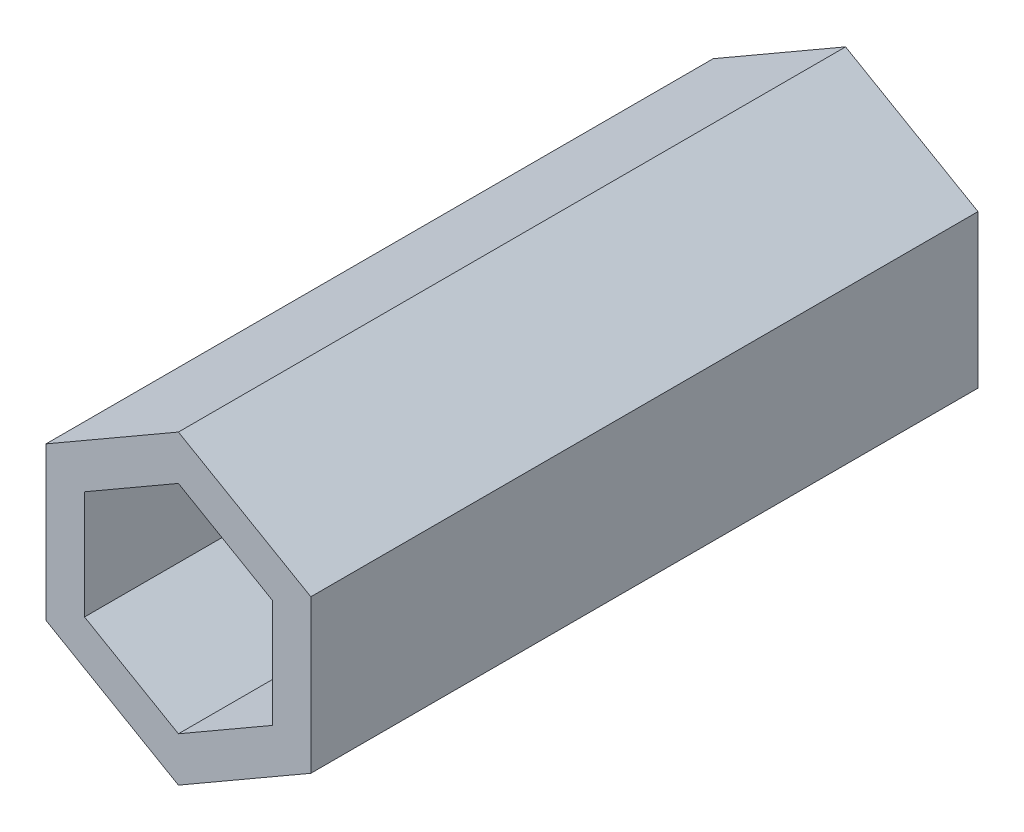
ISO-10303-21;
HEADER;
FILE_DESCRIPTION(('STEP AP214'),'2;1');
FILE_NAME('part.step','',(''),(''),'','','');
FILE_SCHEMA(('AUTOMOTIVE_DESIGN { 1 0 10303 214 1 1 1 1 }'));
ENDSEC;
DATA;
#1=APPLICATION_CONTEXT('core data for automotive mechanical design processes');
#2=APPLICATION_PROTOCOL_DEFINITION('international standard','automotive_design',2000,#1);
#3=PRODUCT_CONTEXT('',#1,'mechanical');
#4=PRODUCT('Part','Part','',(#3));
#5=PRODUCT_RELATED_PRODUCT_CATEGORY('part','',(#4));
#6=PRODUCT_DEFINITION_FORMATION('','',#4);
#7=PRODUCT_DEFINITION_CONTEXT('part definition',#1,'design');
#8=PRODUCT_DEFINITION('design','',#6,#7);
#9=PRODUCT_DEFINITION_SHAPE('','',#8);
#10=(LENGTH_UNIT() NAMED_UNIT(*) SI_UNIT(.MILLI.,.METRE.));
#11=(NAMED_UNIT(*) PLANE_ANGLE_UNIT() SI_UNIT($,.RADIAN.));
#12=(NAMED_UNIT(*) SI_UNIT($,.STERADIAN.) SOLID_ANGLE_UNIT());
#13=UNCERTAINTY_MEASURE_WITH_UNIT(LENGTH_MEASURE(1.E-05),#10,'distance_accuracy_value','');
#14=(GEOMETRIC_REPRESENTATION_CONTEXT(3) GLOBAL_UNCERTAINTY_ASSIGNED_CONTEXT((#13)) GLOBAL_UNIT_ASSIGNED_CONTEXT((#10,
#11,#12)) REPRESENTATION_CONTEXT('',''));
#15=CARTESIAN_POINT('',(0.,0.,0.));
#16=DIRECTION('',(0.,0.,1.));
#17=DIRECTION('',(1.,0.,0.));
#18=AXIS2_PLACEMENT_3D('',#15,#16,#17);
#19=CARTESIAN_POINT('',(-4.76313972081441,-8.25,24.));
#20=DIRECTION('',(0.5,0.866025403784439,0.));
#21=DIRECTION('',(-0.866025403784439,0.5,0.));
#22=AXIS2_PLACEMENT_3D('',#19,#20,#21);
#23=PLANE('',#22);
#24=DIRECTION('',(0.866025403784439,-0.5,0.));
#25=VECTOR('',#24,1.);
#26=CARTESIAN_POINT('',(-4.76313972081441,-8.25,-24.));
#27=LINE('',#26,#25);
#28=CARTESIAN_POINT('',(-9.52627944162882,-5.5,-24.));
#29=VERTEX_POINT('',#28);
#30=CARTESIAN_POINT('',(0.,-11.,-24.));
#31=VERTEX_POINT('',#30);
#32=EDGE_CURVE('E228',#29,#31,#27,.T.);
#33=ORIENTED_EDGE('',*,*,#32,.T.);
#34=DIRECTION('',(0.,0.,-1.));
#35=VECTOR('',#34,1.);
#36=CARTESIAN_POINT('',(0.,-11.,24.));
#37=LINE('',#36,#35);
#38=CARTESIAN_POINT('',(0.,-11.,24.));
#39=VERTEX_POINT('',#38);
#40=EDGE_CURVE('E67',#39,#31,#37,.T.);
#41=ORIENTED_EDGE('',*,*,#40,.F.);
#42=DIRECTION('',(0.866025403784439,-0.5,0.));
#43=VECTOR('',#42,1.);
#44=CARTESIAN_POINT('',(-4.76313972081441,-8.25,24.));
#45=LINE('',#44,#43);
#46=CARTESIAN_POINT('',(-9.52627944162882,-5.5,24.));
#47=VERTEX_POINT('',#46);
#48=EDGE_CURVE('E212',#47,#39,#45,.T.);
#49=ORIENTED_EDGE('',*,*,#48,.F.);
#50=DIRECTION('',(0.,0.,-1.));
#51=VECTOR('',#50,1.);
#52=CARTESIAN_POINT('',(-9.52627944162882,-5.5,24.));
#53=LINE('',#52,#51);
#54=EDGE_CURVE('E12',#47,#29,#53,.T.);
#55=ORIENTED_EDGE('',*,*,#54,.T.);
#56=EDGE_LOOP('',(#33,#41,#49,#55));
#57=FACE_BOUND('',#56,.T.);
#58=ADVANCED_FACE('F59',(#57),#23,.F.);
#59=CARTESIAN_POINT('',(4.76313972081441,-8.25,24.));
#60=DIRECTION('',(-0.5,0.866025403784439,0.));
#61=DIRECTION('',(-0.866025403784439,-0.5,0.));
#62=AXIS2_PLACEMENT_3D('',#59,#60,#61);
#63=PLANE('',#62);
#64=DIRECTION('',(0.866025403784439,0.5,0.));
#65=VECTOR('',#64,1.);
#66=CARTESIAN_POINT('',(4.76313972081441,-8.25,-24.));
#67=LINE('',#66,#65);
#68=CARTESIAN_POINT('',(9.52627944162883,-5.5,-24.));
#69=VERTEX_POINT('',#68);
#70=EDGE_CURVE('E231',#31,#69,#67,.T.);
#71=ORIENTED_EDGE('',*,*,#70,.T.);
#72=DIRECTION('',(0.,0.,-1.));
#73=VECTOR('',#72,1.);
#74=CARTESIAN_POINT('',(9.52627944162883,-5.5,24.));
#75=LINE('',#74,#73);
#76=CARTESIAN_POINT('',(9.52627944162883,-5.5,24.));
#77=VERTEX_POINT('',#76);
#78=EDGE_CURVE('E247',#77,#69,#75,.T.);
#79=ORIENTED_EDGE('',*,*,#78,.F.);
#80=DIRECTION('',(0.866025403784439,0.5,0.));
#81=VECTOR('',#80,1.);
#82=CARTESIAN_POINT('',(4.76313972081441,-8.25,24.));
#83=LINE('',#82,#81);
#84=EDGE_CURVE('E215',#39,#77,#83,.T.);
#85=ORIENTED_EDGE('',*,*,#84,.F.);
#86=ORIENTED_EDGE('',*,*,#40,.T.);
#87=EDGE_LOOP('',(#71,#79,#85,#86));
#88=FACE_BOUND('',#87,.T.);
#89=ADVANCED_FACE('F254',(#88),#63,.F.);
#90=CARTESIAN_POINT('',(9.52627944162882,0.,24.));
#91=DIRECTION('',(-1.,0.,0.));
#92=DIRECTION('',(0.,-1.,0.));
#93=AXIS2_PLACEMENT_3D('',#90,#91,#92);
#94=PLANE('',#93);
#95=DIRECTION('',(0.,1.,0.));
#96=VECTOR('',#95,1.);
#97=CARTESIAN_POINT('',(9.52627944162882,0.,-24.));
#98=LINE('',#97,#96);
#99=CARTESIAN_POINT('',(9.52627944162882,5.5,-24.));
#100=VERTEX_POINT('',#99);
#101=EDGE_CURVE('E233',#69,#100,#98,.T.);
#102=ORIENTED_EDGE('',*,*,#101,.T.);
#103=DIRECTION('',(0.,0.,-1.));
#104=VECTOR('',#103,1.);
#105=CARTESIAN_POINT('',(9.52627944162882,5.5,24.));
#106=LINE('',#105,#104);
#107=CARTESIAN_POINT('',(9.52627944162882,5.5,24.));
#108=VERTEX_POINT('',#107);
#109=EDGE_CURVE('E244',#108,#100,#106,.T.);
#110=ORIENTED_EDGE('',*,*,#109,.F.);
#111=DIRECTION('',(0.,1.,0.));
#112=VECTOR('',#111,1.);
#113=CARTESIAN_POINT('',(9.52627944162882,0.,24.));
#114=LINE('',#113,#112);
#115=EDGE_CURVE('E217',#77,#108,#114,.T.);
#116=ORIENTED_EDGE('',*,*,#115,.F.);
#117=ORIENTED_EDGE('',*,*,#78,.T.);
#118=EDGE_LOOP('',(#102,#110,#116,#117));
#119=FACE_BOUND('',#118,.T.);
#120=ADVANCED_FACE('F265',(#119),#94,.F.);
#121=CARTESIAN_POINT('',(4.76313972081441,8.25,24.));
#122=DIRECTION('',(-0.5,-0.866025403784439,0.));
#123=DIRECTION('',(0.866025403784439,-0.5,0.));
#124=AXIS2_PLACEMENT_3D('',#121,#122,#123);
#125=PLANE('',#124);
#126=DIRECTION('',(-0.866025403784439,0.5,0.));
#127=VECTOR('',#126,1.);
#128=CARTESIAN_POINT('',(4.76313972081441,8.25,-24.));
#129=LINE('',#128,#127);
#130=CARTESIAN_POINT('',(0.,11.,-24.));
#131=VERTEX_POINT('',#130);
#132=EDGE_CURVE('E235',#100,#131,#129,.T.);
#133=ORIENTED_EDGE('',*,*,#132,.T.);
#134=DIRECTION('',(0.,0.,-1.));
#135=VECTOR('',#134,1.);
#136=CARTESIAN_POINT('',(0.,11.,24.));
#137=LINE('',#136,#135);
#138=CARTESIAN_POINT('',(0.,11.,24.));
#139=VERTEX_POINT('',#138);
#140=EDGE_CURVE('E240',#139,#131,#137,.T.);
#141=ORIENTED_EDGE('',*,*,#140,.F.);
#142=DIRECTION('',(-0.866025403784439,0.5,0.));
#143=VECTOR('',#142,1.);
#144=CARTESIAN_POINT('',(4.76313972081441,8.25,24.));
#145=LINE('',#144,#143);
#146=EDGE_CURVE('E220',#108,#139,#145,.T.);
#147=ORIENTED_EDGE('',*,*,#146,.F.);
#148=ORIENTED_EDGE('',*,*,#109,.T.);
#149=EDGE_LOOP('',(#133,#141,#147,#148));
#150=FACE_BOUND('',#149,.T.);
#151=ADVANCED_FACE('F269',(#150),#125,.F.);
#152=CARTESIAN_POINT('',(-4.76313972081441,8.25,24.));
#153=DIRECTION('',(0.5,-0.866025403784439,0.));
#154=DIRECTION('',(0.866025403784439,0.5,0.));
#155=AXIS2_PLACEMENT_3D('',#152,#153,#154);
#156=PLANE('',#155);
#157=DIRECTION('',(-0.866025403784439,-0.5,0.));
#158=VECTOR('',#157,1.);
#159=CARTESIAN_POINT('',(-4.76313972081441,8.25,-24.));
#160=LINE('',#159,#158);
#161=CARTESIAN_POINT('',(-9.52627944162882,5.5,-24.));
#162=VERTEX_POINT('',#161);
#163=EDGE_CURVE('E213',#131,#162,#160,.T.);
#164=ORIENTED_EDGE('',*,*,#163,.T.);
#165=DIRECTION('',(0.,0.,-1.));
#166=VECTOR('',#165,1.);
#167=CARTESIAN_POINT('',(-9.52627944162882,5.5,24.));
#168=LINE('',#167,#166);
#169=CARTESIAN_POINT('',(-9.52627944162882,5.5,24.));
#170=VERTEX_POINT('',#169);
#171=EDGE_CURVE('E225',#170,#162,#168,.T.);
#172=ORIENTED_EDGE('',*,*,#171,.F.);
#173=DIRECTION('',(-0.866025403784439,-0.5,0.));
#174=VECTOR('',#173,1.);
#175=CARTESIAN_POINT('',(-4.76313972081441,8.25,24.));
#176=LINE('',#175,#174);
#177=EDGE_CURVE('E222',#139,#170,#176,.T.);
#178=ORIENTED_EDGE('',*,*,#177,.F.);
#179=ORIENTED_EDGE('',*,*,#140,.T.);
#180=EDGE_LOOP('',(#164,#172,#178,#179));
#181=FACE_BOUND('',#180,.T.);
#182=ADVANCED_FACE('F277',(#181),#156,.F.);
#183=CARTESIAN_POINT('',(-9.52627944162882,0.,24.));
#184=DIRECTION('',(1.,0.,0.));
#185=DIRECTION('',(0.,1.,0.));
#186=AXIS2_PLACEMENT_3D('',#183,#184,#185);
#187=PLANE('',#186);
#188=DIRECTION('',(0.,-1.,0.));
#189=VECTOR('',#188,1.);
#190=CARTESIAN_POINT('',(-9.52627944162882,0.,-24.));
#191=LINE('',#190,#189);
#192=EDGE_CURVE('E200',#162,#29,#191,.T.);
#193=ORIENTED_EDGE('',*,*,#192,.T.);
#194=ORIENTED_EDGE('',*,*,#54,.F.);
#195=DIRECTION('',(0.,-1.,0.));
#196=VECTOR('',#195,1.);
#197=CARTESIAN_POINT('',(-9.52627944162882,0.,24.));
#198=LINE('',#197,#196);
#199=EDGE_CURVE('E209',#170,#47,#198,.T.);
#200=ORIENTED_EDGE('',*,*,#199,.F.);
#201=ORIENTED_EDGE('',*,*,#171,.T.);
#202=EDGE_LOOP('',(#193,#194,#200,#201));
#203=FACE_BOUND('',#202,.T.);
#204=ADVANCED_FACE('F61',(#203),#187,.F.);
#205=CARTESIAN_POINT('',(0.,0.,-24.));
#206=DIRECTION('',(0.,0.,1.));
#207=DIRECTION('',(1.,0.,0.));
#208=AXIS2_PLACEMENT_3D('',#205,#206,#207);
#209=PLANE('',#208);
#210=DIRECTION('',(0.,-1.,0.));
#211=VECTOR('',#210,1.);
#212=CARTESIAN_POINT('',(-6.75499814951862,3.9,-24.));
#213=LINE('',#212,#211);
#214=CARTESIAN_POINT('',(-6.75499814951862,3.9,-24.));
#215=VERTEX_POINT('',#214);
#216=CARTESIAN_POINT('',(-6.75499814951862,-3.9,-24.));
#217=VERTEX_POINT('',#216);
#218=EDGE_CURVE('E195',#215,#217,#213,.T.);
#219=ORIENTED_EDGE('',*,*,#218,.T.);
#220=DIRECTION('',(0.866025403784439,-0.5,0.));
#221=VECTOR('',#220,1.);
#222=CARTESIAN_POINT('',(-6.75499814951862,-3.9,-24.));
#223=LINE('',#222,#221);
#224=CARTESIAN_POINT('',(0.,-7.8,-24.));
#225=VERTEX_POINT('',#224);
#226=EDGE_CURVE('E180',#217,#225,#223,.T.);
#227=ORIENTED_EDGE('',*,*,#226,.T.);
#228=DIRECTION('',(0.866025403784439,0.5,0.));
#229=VECTOR('',#228,1.);
#230=CARTESIAN_POINT('',(0.,-7.8,-24.));
#231=LINE('',#230,#229);
#232=CARTESIAN_POINT('',(6.75499814951862,-3.9,-24.));
#233=VERTEX_POINT('',#232);
#234=EDGE_CURVE('E183',#225,#233,#231,.T.);
#235=ORIENTED_EDGE('',*,*,#234,.T.);
#236=DIRECTION('',(0.,1.,0.));
#237=VECTOR('',#236,1.);
#238=CARTESIAN_POINT('',(6.75499814951862,-3.9,-24.));
#239=LINE('',#238,#237);
#240=CARTESIAN_POINT('',(6.75499814951862,3.9,-24.));
#241=VERTEX_POINT('',#240);
#242=EDGE_CURVE('E74',#233,#241,#239,.T.);
#243=ORIENTED_EDGE('',*,*,#242,.T.);
#244=DIRECTION('',(-0.866025403784439,0.5,0.));
#245=VECTOR('',#244,1.);
#246=CARTESIAN_POINT('',(6.75499814951862,3.9,-24.));
#247=LINE('',#246,#245);
#248=CARTESIAN_POINT('',(0.,7.8,-24.));
#249=VERTEX_POINT('',#248);
#250=EDGE_CURVE('E188',#241,#249,#247,.T.);
#251=ORIENTED_EDGE('',*,*,#250,.T.);
#252=DIRECTION('',(-0.866025403784439,-0.5,0.));
#253=VECTOR('',#252,1.);
#254=CARTESIAN_POINT('',(0.,7.8,-24.));
#255=LINE('',#254,#253);
#256=EDGE_CURVE('E192',#249,#215,#255,.T.);
#257=ORIENTED_EDGE('',*,*,#256,.T.);
#258=EDGE_LOOP('',(#219,#227,#235,#243,#251,#257));
#259=FACE_BOUND('',#258,.T.);
#260=ORIENTED_EDGE('',*,*,#192,.F.);
#261=ORIENTED_EDGE('',*,*,#163,.F.);
#262=ORIENTED_EDGE('',*,*,#132,.F.);
#263=ORIENTED_EDGE('',*,*,#101,.F.);
#264=ORIENTED_EDGE('',*,*,#70,.F.);
#265=ORIENTED_EDGE('',*,*,#32,.F.);
#266=EDGE_LOOP('',(#260,#261,#262,#263,#264,#265));
#267=FACE_BOUND('',#266,.T.);
#268=ADVANCED_FACE('F260',(#259,#267),#209,.F.);
#269=CARTESIAN_POINT('',(0.,0.,24.));
#270=DIRECTION('',(0.,0.,1.));
#271=DIRECTION('',(1.,0.,0.));
#272=AXIS2_PLACEMENT_3D('',#269,#270,#271);
#273=PLANE('',#272);
#274=DIRECTION('',(0.866025403784439,-0.5,0.));
#275=VECTOR('',#274,1.);
#276=CARTESIAN_POINT('',(-6.75499814951862,-3.9,24.));
#277=LINE('',#276,#275);
#278=CARTESIAN_POINT('',(-6.75499814951862,-3.9,24.));
#279=VERTEX_POINT('',#278);
#280=CARTESIAN_POINT('',(0.,-7.8,24.));
#281=VERTEX_POINT('',#280);
#282=EDGE_CURVE('E82',#279,#281,#277,.T.);
#283=ORIENTED_EDGE('',*,*,#282,.F.);
#284=DIRECTION('',(0.,-1.,0.));
#285=VECTOR('',#284,1.);
#286=CARTESIAN_POINT('',(-6.75499814951862,3.9,24.));
#287=LINE('',#286,#285);
#288=CARTESIAN_POINT('',(-6.75499814951862,3.9,24.));
#289=VERTEX_POINT('',#288);
#290=EDGE_CURVE('E176',#289,#279,#287,.T.);
#291=ORIENTED_EDGE('',*,*,#290,.F.);
#292=DIRECTION('',(-0.866025403784439,-0.5,0.));
#293=VECTOR('',#292,1.);
#294=CARTESIAN_POINT('',(0.,7.8,24.));
#295=LINE('',#294,#293);
#296=CARTESIAN_POINT('',(0.,7.8,24.));
#297=VERTEX_POINT('',#296);
#298=EDGE_CURVE('E170',#297,#289,#295,.T.);
#299=ORIENTED_EDGE('',*,*,#298,.F.);
#300=DIRECTION('',(-0.866025403784439,0.5,0.));
#301=VECTOR('',#300,1.);
#302=CARTESIAN_POINT('',(6.75499814951862,3.9,24.));
#303=LINE('',#302,#301);
#304=CARTESIAN_POINT('',(6.75499814951862,3.9,24.));
#305=VERTEX_POINT('',#304);
#306=EDGE_CURVE('E167',#305,#297,#303,.T.);
#307=ORIENTED_EDGE('',*,*,#306,.F.);
#308=DIRECTION('',(0.,1.,0.));
#309=VECTOR('',#308,1.);
#310=CARTESIAN_POINT('',(6.75499814951862,-3.9,24.));
#311=LINE('',#310,#309);
#312=CARTESIAN_POINT('',(6.75499814951862,-3.9,24.));
#313=VERTEX_POINT('',#312);
#314=EDGE_CURVE('E150',#313,#305,#311,.T.);
#315=ORIENTED_EDGE('',*,*,#314,.F.);
#316=DIRECTION('',(0.866025403784439,0.5,0.));
#317=VECTOR('',#316,1.);
#318=CARTESIAN_POINT('',(0.,-7.8,24.));
#319=LINE('',#318,#317);
#320=EDGE_CURVE('E159',#281,#313,#319,.T.);
#321=ORIENTED_EDGE('',*,*,#320,.F.);
#322=EDGE_LOOP('',(#283,#291,#299,#307,#315,#321));
#323=FACE_BOUND('',#322,.T.);
#324=ORIENTED_EDGE('',*,*,#199,.T.);
#325=ORIENTED_EDGE('',*,*,#48,.T.);
#326=ORIENTED_EDGE('',*,*,#84,.T.);
#327=ORIENTED_EDGE('',*,*,#115,.T.);
#328=ORIENTED_EDGE('',*,*,#146,.T.);
#329=ORIENTED_EDGE('',*,*,#177,.T.);
#330=EDGE_LOOP('',(#324,#325,#326,#327,#328,#329));
#331=FACE_BOUND('',#330,.T.);
#332=ADVANCED_FACE('F163',(#323,#331),#273,.T.);
#333=CARTESIAN_POINT('',(-6.75499814951862,-3.9,-24.));
#334=DIRECTION('',(-0.5,-0.866025403784439,0.));
#335=DIRECTION('',(0.866025403784439,-0.5,0.));
#336=AXIS2_PLACEMENT_3D('',#333,#334,#335);
#337=PLANE('',#336);
#338=DIRECTION('',(0.,0.,1.));
#339=VECTOR('',#338,1.);
#340=CARTESIAN_POINT('',(0.,-7.8,-24.));
#341=LINE('',#340,#339);
#342=EDGE_CURVE('E156',#225,#281,#341,.T.);
#343=ORIENTED_EDGE('',*,*,#342,.F.);
#344=ORIENTED_EDGE('',*,*,#226,.F.);
#345=DIRECTION('',(0.,0.,1.));
#346=VECTOR('',#345,1.);
#347=CARTESIAN_POINT('',(-6.75499814951862,-3.9,-24.));
#348=LINE('',#347,#346);
#349=EDGE_CURVE('E198',#217,#279,#348,.T.);
#350=ORIENTED_EDGE('',*,*,#349,.T.);
#351=ORIENTED_EDGE('',*,*,#282,.T.);
#352=EDGE_LOOP('',(#343,#344,#350,#351));
#353=FACE_BOUND('',#352,.T.);
#354=ADVANCED_FACE('F330',(#353),#337,.F.);
#355=CARTESIAN_POINT('',(-6.75499814951862,3.9,-24.));
#356=DIRECTION('',(-1.,0.,0.));
#357=DIRECTION('',(0.,-1.,0.));
#358=AXIS2_PLACEMENT_3D('',#355,#356,#357);
#359=PLANE('',#358);
#360=ORIENTED_EDGE('',*,*,#349,.F.);
#361=ORIENTED_EDGE('',*,*,#218,.F.);
#362=DIRECTION('',(0.,0.,1.));
#363=VECTOR('',#362,1.);
#364=CARTESIAN_POINT('',(-6.75499814951862,3.9,-24.));
#365=LINE('',#364,#363);
#366=EDGE_CURVE('E201',#215,#289,#365,.T.);
#367=ORIENTED_EDGE('',*,*,#366,.T.);
#368=ORIENTED_EDGE('',*,*,#290,.T.);
#369=EDGE_LOOP('',(#360,#361,#367,#368));
#370=FACE_BOUND('',#369,.T.);
#371=ADVANCED_FACE('F339',(#370),#359,.F.);
#372=CARTESIAN_POINT('',(0.,7.8,-24.));
#373=DIRECTION('',(-0.5,0.866025403784438,0.));
#374=DIRECTION('',(-0.866025403784439,-0.5,0.));
#375=AXIS2_PLACEMENT_3D('',#372,#373,#374);
#376=PLANE('',#375);
#377=ORIENTED_EDGE('',*,*,#366,.F.);
#378=ORIENTED_EDGE('',*,*,#256,.F.);
#379=DIRECTION('',(0.,0.,1.));
#380=VECTOR('',#379,1.);
#381=CARTESIAN_POINT('',(0.,7.8,-24.));
#382=LINE('',#381,#380);
#383=EDGE_CURVE('E204',#249,#297,#382,.T.);
#384=ORIENTED_EDGE('',*,*,#383,.T.);
#385=ORIENTED_EDGE('',*,*,#298,.T.);
#386=EDGE_LOOP('',(#377,#378,#384,#385));
#387=FACE_BOUND('',#386,.T.);
#388=ADVANCED_FACE('F348',(#387),#376,.F.);
#389=CARTESIAN_POINT('',(6.75499814951862,3.9,-24.));
#390=DIRECTION('',(0.5,0.866025403784439,0.));
#391=DIRECTION('',(-0.866025403784439,0.5,0.));
#392=AXIS2_PLACEMENT_3D('',#389,#390,#391);
#393=PLANE('',#392);
#394=ORIENTED_EDGE('',*,*,#383,.F.);
#395=ORIENTED_EDGE('',*,*,#250,.F.);
#396=DIRECTION('',(0.,0.,1.));
#397=VECTOR('',#396,1.);
#398=CARTESIAN_POINT('',(6.75499814951862,3.9,-24.));
#399=LINE('',#398,#397);
#400=EDGE_CURVE('E155',#241,#305,#399,.T.);
#401=ORIENTED_EDGE('',*,*,#400,.T.);
#402=ORIENTED_EDGE('',*,*,#306,.T.);
#403=EDGE_LOOP('',(#394,#395,#401,#402));
#404=FACE_BOUND('',#403,.T.);
#405=ADVANCED_FACE('F358',(#404),#393,.F.);
#406=CARTESIAN_POINT('',(6.75499814951862,-3.9,-24.));
#407=DIRECTION('',(1.,0.,0.));
#408=DIRECTION('',(0.,1.,0.));
#409=AXIS2_PLACEMENT_3D('',#406,#407,#408);
#410=PLANE('',#409);
#411=ORIENTED_EDGE('',*,*,#400,.F.);
#412=ORIENTED_EDGE('',*,*,#242,.F.);
#413=DIRECTION('',(0.,0.,1.));
#414=VECTOR('',#413,1.);
#415=CARTESIAN_POINT('',(6.75499814951862,-3.9,-24.));
#416=LINE('',#415,#414);
#417=EDGE_CURVE('E146',#233,#313,#416,.T.);
#418=ORIENTED_EDGE('',*,*,#417,.T.);
#419=ORIENTED_EDGE('',*,*,#314,.T.);
#420=EDGE_LOOP('',(#411,#412,#418,#419));
#421=FACE_BOUND('',#420,.T.);
#422=ADVANCED_FACE('F148',(#421),#410,.F.);
#423=CARTESIAN_POINT('',(0.,-7.8,-24.));
#424=DIRECTION('',(0.5,-0.866025403784439,0.));
#425=DIRECTION('',(0.866025403784439,0.5,0.));
#426=AXIS2_PLACEMENT_3D('',#423,#424,#425);
#427=PLANE('',#426);
#428=ORIENTED_EDGE('',*,*,#417,.F.);
#429=ORIENTED_EDGE('',*,*,#234,.F.);
#430=ORIENTED_EDGE('',*,*,#342,.T.);
#431=ORIENTED_EDGE('',*,*,#320,.T.);
#432=EDGE_LOOP('',(#428,#429,#430,#431));
#433=FACE_BOUND('',#432,.T.);
#434=ADVANCED_FACE('F160',(#433),#427,.F.);
#435=CLOSED_SHELL('',(#58,#89,#120,#151,#182,#204,#268,#332,#354,#371,#388,#405,#422,#434));
#436=MANIFOLD_SOLID_BREP('B2',#435);
#437=ADVANCED_BREP_SHAPE_REPRESENTATION('',(#18,#436),#14);
#438=SHAPE_DEFINITION_REPRESENTATION(#9,#437);
ENDSEC;
END-ISO-10303-21;
